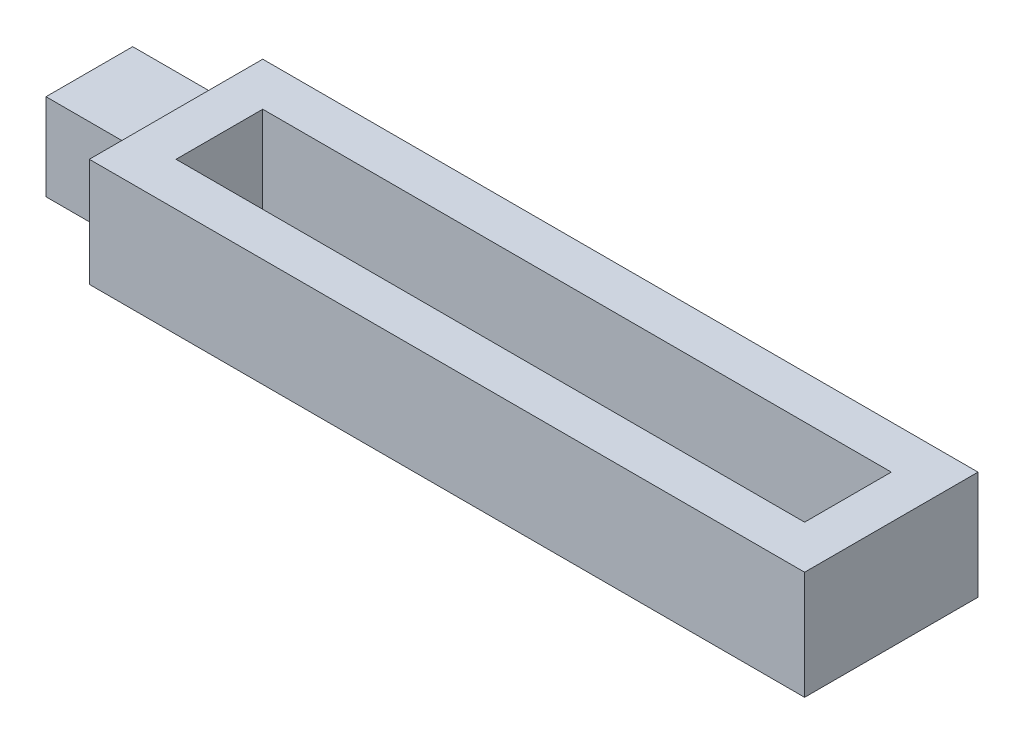
ISO-10303-21;
HEADER;
FILE_DESCRIPTION(('STEP AP214'),'2;1');
FILE_NAME('part.step','',(''),(''),'','','');
FILE_SCHEMA(('AUTOMOTIVE_DESIGN { 1 0 10303 214 1 1 1 1 }'));
ENDSEC;
DATA;
#1=APPLICATION_CONTEXT('core data for automotive mechanical design processes');
#2=APPLICATION_PROTOCOL_DEFINITION('international standard','automotive_design',2000,#1);
#3=PRODUCT_CONTEXT('',#1,'mechanical');
#4=PRODUCT('Part','Part','',(#3));
#5=PRODUCT_RELATED_PRODUCT_CATEGORY('part','',(#4));
#6=PRODUCT_DEFINITION_FORMATION('','',#4);
#7=PRODUCT_DEFINITION_CONTEXT('part definition',#1,'design');
#8=PRODUCT_DEFINITION('design','',#6,#7);
#9=PRODUCT_DEFINITION_SHAPE('','',#8);
#10=(LENGTH_UNIT() NAMED_UNIT(*) SI_UNIT(.MILLI.,.METRE.));
#11=(NAMED_UNIT(*) PLANE_ANGLE_UNIT() SI_UNIT($,.RADIAN.));
#12=(NAMED_UNIT(*) SI_UNIT($,.STERADIAN.) SOLID_ANGLE_UNIT());
#13=UNCERTAINTY_MEASURE_WITH_UNIT(LENGTH_MEASURE(1.E-05),#10,'distance_accuracy_value','');
#14=(GEOMETRIC_REPRESENTATION_CONTEXT(3) GLOBAL_UNCERTAINTY_ASSIGNED_CONTEXT((#13)) GLOBAL_UNIT_ASSIGNED_CONTEXT((#10,
#11,#12)) REPRESENTATION_CONTEXT('',''));
#15=CARTESIAN_POINT('',(0.,0.,0.));
#16=DIRECTION('',(0.,0.,1.));
#17=DIRECTION('',(1.,0.,0.));
#18=AXIS2_PLACEMENT_3D('',#15,#16,#17);
#19=CARTESIAN_POINT('',(330.,50.,0.));
#20=DIRECTION('',(1.,0.,0.));
#21=DIRECTION('',(0.,0.,-1.));
#22=AXIS2_PLACEMENT_3D('',#19,#20,#21);
#23=PLANE('',#22);
#24=DIRECTION('',(0.,-1.,0.));
#25=VECTOR('',#24,1.);
#26=CARTESIAN_POINT('',(330.,50.,79.9999999999999));
#27=LINE('',#26,#25);
#28=CARTESIAN_POINT('',(330.,50.,79.9999999999999));
#29=VERTEX_POINT('',#28);
#30=CARTESIAN_POINT('',(330.,-50.,79.9999999999999));
#31=VERTEX_POINT('',#30);
#32=EDGE_CURVE('E207',#29,#31,#27,.T.);
#33=ORIENTED_EDGE('',*,*,#32,.T.);
#34=DIRECTION('',(0.,0.,1.));
#35=VECTOR('',#34,1.);
#36=CARTESIAN_POINT('',(330.,-50.,0.));
#37=LINE('',#36,#35);
#38=CARTESIAN_POINT('',(330.,-50.,-79.9999999999999));
#39=VERTEX_POINT('',#38);
#40=EDGE_CURVE('E173',#39,#31,#37,.T.);
#41=ORIENTED_EDGE('',*,*,#40,.F.);
#42=DIRECTION('',(0.,-1.,0.));
#43=VECTOR('',#42,1.);
#44=CARTESIAN_POINT('',(330.,50.,-79.9999999999999));
#45=LINE('',#44,#43);
#46=CARTESIAN_POINT('',(330.,50.,-79.9999999999999));
#47=VERTEX_POINT('',#46);
#48=EDGE_CURVE('E11',#47,#39,#45,.T.);
#49=ORIENTED_EDGE('',*,*,#48,.F.);
#50=DIRECTION('',(0.,0.,1.));
#51=VECTOR('',#50,1.);
#52=CARTESIAN_POINT('',(330.,50.,0.));
#53=LINE('',#52,#51);
#54=EDGE_CURVE('E195',#47,#29,#53,.T.);
#55=ORIENTED_EDGE('',*,*,#54,.T.);
#56=EDGE_LOOP('',(#33,#41,#49,#55));
#57=FACE_BOUND('',#56,.T.);
#58=ADVANCED_FACE('F35',(#57),#23,.T.);
#59=CARTESIAN_POINT('',(0.,50.,-79.9999999999999));
#60=DIRECTION('',(0.,0.,-1.));
#61=DIRECTION('',(-1.,0.,0.));
#62=AXIS2_PLACEMENT_3D('',#59,#60,#61);
#63=PLANE('',#62);
#64=ORIENTED_EDGE('',*,*,#48,.T.);
#65=DIRECTION('',(1.,0.,0.));
#66=VECTOR('',#65,1.);
#67=CARTESIAN_POINT('',(0.,-50.,-79.9999999999999));
#68=LINE('',#67,#66);
#69=CARTESIAN_POINT('',(-330.,-50.,-79.9999999999999));
#70=VERTEX_POINT('',#69);
#71=EDGE_CURVE('E176',#70,#39,#68,.T.);
#72=ORIENTED_EDGE('',*,*,#71,.F.);
#73=DIRECTION('',(0.,-1.,0.));
#74=VECTOR('',#73,1.);
#75=CARTESIAN_POINT('',(-330.,50.,-79.9999999999999));
#76=LINE('',#75,#74);
#77=CARTESIAN_POINT('',(-330.,50.,-79.9999999999999));
#78=VERTEX_POINT('',#77);
#79=EDGE_CURVE('E44',#78,#70,#76,.T.);
#80=ORIENTED_EDGE('',*,*,#79,.F.);
#81=DIRECTION('',(1.,0.,0.));
#82=VECTOR('',#81,1.);
#83=CARTESIAN_POINT('',(0.,50.,-79.9999999999999));
#84=LINE('',#83,#82);
#85=EDGE_CURVE('E198',#78,#47,#84,.T.);
#86=ORIENTED_EDGE('',*,*,#85,.T.);
#87=EDGE_LOOP('',(#64,#72,#80,#86));
#88=FACE_BOUND('',#87,.T.);
#89=ADVANCED_FACE('F244',(#88),#63,.T.);
#90=CARTESIAN_POINT('',(-330.,50.,0.));
#91=DIRECTION('',(1.,0.,0.));
#92=DIRECTION('',(0.,0.,-1.));
#93=AXIS2_PLACEMENT_3D('',#90,#91,#92);
#94=PLANE('',#93);
#95=DIRECTION('',(0.,0.,1.));
#96=VECTOR('',#95,1.);
#97=CARTESIAN_POINT('',(-330.,-40.,0.));
#98=LINE('',#97,#96);
#99=CARTESIAN_POINT('',(-330.,-40.,-40.));
#100=VERTEX_POINT('',#99);
#101=CARTESIAN_POINT('',(-330.,-40.,39.9999999999999));
#102=VERTEX_POINT('',#101);
#103=EDGE_CURVE('E134',#100,#102,#98,.T.);
#104=ORIENTED_EDGE('',*,*,#103,.F.);
#105=DIRECTION('',(0.,1.,0.));
#106=VECTOR('',#105,1.);
#107=CARTESIAN_POINT('',(-330.,-40.,-40.));
#108=LINE('',#107,#106);
#109=CARTESIAN_POINT('',(-330.,40.,-40.));
#110=VERTEX_POINT('',#109);
#111=EDGE_CURVE('E52',#100,#110,#108,.T.);
#112=ORIENTED_EDGE('',*,*,#111,.T.);
#113=DIRECTION('',(0.,0.,1.));
#114=VECTOR('',#113,1.);
#115=CARTESIAN_POINT('',(-330.,40.,0.));
#116=LINE('',#115,#114);
#117=CARTESIAN_POINT('',(-330.,40.,39.9999999999999));
#118=VERTEX_POINT('',#117);
#119=EDGE_CURVE('E57',#110,#118,#116,.T.);
#120=ORIENTED_EDGE('',*,*,#119,.T.);
#121=DIRECTION('',(0.,1.,0.));
#122=VECTOR('',#121,1.);
#123=CARTESIAN_POINT('',(-330.,-40.,39.9999999999999));
#124=LINE('',#123,#122);
#125=EDGE_CURVE('E159',#102,#118,#124,.T.);
#126=ORIENTED_EDGE('',*,*,#125,.F.);
#127=EDGE_LOOP('',(#104,#112,#120,#126));
#128=FACE_BOUND('',#127,.T.);
#129=ORIENTED_EDGE('',*,*,#79,.T.);
#130=DIRECTION('',(0.,0.,1.));
#131=VECTOR('',#130,1.);
#132=CARTESIAN_POINT('',(-330.,-50.,0.));
#133=LINE('',#132,#131);
#134=CARTESIAN_POINT('',(-330.,-50.,79.9999999999999));
#135=VERTEX_POINT('',#134);
#136=EDGE_CURVE('E179',#70,#135,#133,.T.);
#137=ORIENTED_EDGE('',*,*,#136,.T.);
#138=DIRECTION('',(0.,-1.,0.));
#139=VECTOR('',#138,1.);
#140=CARTESIAN_POINT('',(-330.,50.,79.9999999999999));
#141=LINE('',#140,#139);
#142=CARTESIAN_POINT('',(-330.,50.,79.9999999999999));
#143=VERTEX_POINT('',#142);
#144=EDGE_CURVE('E209',#143,#135,#141,.T.);
#145=ORIENTED_EDGE('',*,*,#144,.F.);
#146=DIRECTION('',(0.,0.,1.));
#147=VECTOR('',#146,1.);
#148=CARTESIAN_POINT('',(-330.,50.,0.));
#149=LINE('',#148,#147);
#150=EDGE_CURVE('E201',#78,#143,#149,.T.);
#151=ORIENTED_EDGE('',*,*,#150,.F.);
#152=EDGE_LOOP('',(#129,#137,#145,#151));
#153=FACE_BOUND('',#152,.T.);
#154=ADVANCED_FACE('F250',(#128,#153),#94,.F.);
#155=CARTESIAN_POINT('',(290.,50.,0.));
#156=DIRECTION('',(-1.,0.,0.));
#157=DIRECTION('',(0.,0.,1.));
#158=AXIS2_PLACEMENT_3D('',#155,#156,#157);
#159=PLANE('',#158);
#160=DIRECTION('',(0.,-1.,0.));
#161=VECTOR('',#160,1.);
#162=CARTESIAN_POINT('',(290.,50.,-40.));
#163=LINE('',#162,#161);
#164=CARTESIAN_POINT('',(290.,50.,-40.));
#165=VERTEX_POINT('',#164);
#166=CARTESIAN_POINT('',(290.,-50.,-40.));
#167=VERTEX_POINT('',#166);
#168=EDGE_CURVE('E206',#165,#167,#163,.T.);
#169=ORIENTED_EDGE('',*,*,#168,.T.);
#170=DIRECTION('',(0.,0.,-1.));
#171=VECTOR('',#170,1.);
#172=CARTESIAN_POINT('',(290.,-50.,0.));
#173=LINE('',#172,#171);
#174=CARTESIAN_POINT('',(290.,-50.,40.));
#175=VERTEX_POINT('',#174);
#176=EDGE_CURVE('E158',#175,#167,#173,.T.);
#177=ORIENTED_EDGE('',*,*,#176,.F.);
#178=DIRECTION('',(0.,-1.,0.));
#179=VECTOR('',#178,1.);
#180=CARTESIAN_POINT('',(290.,50.,40.));
#181=LINE('',#180,#179);
#182=CARTESIAN_POINT('',(290.,50.,40.));
#183=VERTEX_POINT('',#182);
#184=EDGE_CURVE('E39',#183,#175,#181,.T.);
#185=ORIENTED_EDGE('',*,*,#184,.F.);
#186=DIRECTION('',(0.,0.,-1.));
#187=VECTOR('',#186,1.);
#188=CARTESIAN_POINT('',(290.,50.,0.));
#189=LINE('',#188,#187);
#190=EDGE_CURVE('E185',#183,#165,#189,.T.);
#191=ORIENTED_EDGE('',*,*,#190,.T.);
#192=EDGE_LOOP('',(#169,#177,#185,#191));
#193=FACE_BOUND('',#192,.T.);
#194=ADVANCED_FACE('F37',(#193),#159,.T.);
#195=CARTESIAN_POINT('',(0.,50.,40.));
#196=DIRECTION('',(0.,0.,-1.));
#197=DIRECTION('',(-1.,0.,0.));
#198=AXIS2_PLACEMENT_3D('',#195,#196,#197);
#199=PLANE('',#198);
#200=ORIENTED_EDGE('',*,*,#184,.T.);
#201=DIRECTION('',(1.,0.,0.));
#202=VECTOR('',#201,1.);
#203=CARTESIAN_POINT('',(0.,-50.,40.));
#204=LINE('',#203,#202);
#205=CARTESIAN_POINT('',(-290.,-50.,39.9999999999999));
#206=VERTEX_POINT('',#205);
#207=EDGE_CURVE('E164',#206,#175,#204,.T.);
#208=ORIENTED_EDGE('',*,*,#207,.F.);
#209=DIRECTION('',(0.,-1.,0.));
#210=VECTOR('',#209,1.);
#211=CARTESIAN_POINT('',(-290.,50.,39.9999999999999));
#212=LINE('',#211,#210);
#213=CARTESIAN_POINT('',(-290.,50.,39.9999999999999));
#214=VERTEX_POINT('',#213);
#215=EDGE_CURVE('E214',#214,#206,#212,.T.);
#216=ORIENTED_EDGE('',*,*,#215,.F.);
#217=DIRECTION('',(1.,0.,0.));
#218=VECTOR('',#217,1.);
#219=CARTESIAN_POINT('',(0.,50.,40.));
#220=LINE('',#219,#218);
#221=EDGE_CURVE('E188',#214,#183,#220,.T.);
#222=ORIENTED_EDGE('',*,*,#221,.T.);
#223=EDGE_LOOP('',(#200,#208,#216,#222));
#224=FACE_BOUND('',#223,.T.);
#225=ADVANCED_FACE('F219',(#224),#199,.T.);
#226=CARTESIAN_POINT('',(-290.,50.,0.));
#227=DIRECTION('',(-1.,0.,0.));
#228=DIRECTION('',(0.,0.,1.));
#229=AXIS2_PLACEMENT_3D('',#226,#227,#228);
#230=PLANE('',#229);
#231=ORIENTED_EDGE('',*,*,#215,.T.);
#232=DIRECTION('',(0.,0.,-1.));
#233=VECTOR('',#232,1.);
#234=CARTESIAN_POINT('',(-290.,-50.,0.));
#235=LINE('',#234,#233);
#236=CARTESIAN_POINT('',(-290.,-50.,-40.));
#237=VERTEX_POINT('',#236);
#238=EDGE_CURVE('E167',#206,#237,#235,.T.);
#239=ORIENTED_EDGE('',*,*,#238,.T.);
#240=DIRECTION('',(0.,-1.,0.));
#241=VECTOR('',#240,1.);
#242=CARTESIAN_POINT('',(-290.,50.,-40.));
#243=LINE('',#242,#241);
#244=CARTESIAN_POINT('',(-290.,50.,-40.));
#245=VERTEX_POINT('',#244);
#246=EDGE_CURVE('E213',#245,#237,#243,.T.);
#247=ORIENTED_EDGE('',*,*,#246,.F.);
#248=DIRECTION('',(0.,0.,-1.));
#249=VECTOR('',#248,1.);
#250=CARTESIAN_POINT('',(-290.,50.,0.));
#251=LINE('',#250,#249);
#252=EDGE_CURVE('E191',#214,#245,#251,.T.);
#253=ORIENTED_EDGE('',*,*,#252,.F.);
#254=EDGE_LOOP('',(#231,#239,#247,#253));
#255=FACE_BOUND('',#254,.T.);
#256=ADVANCED_FACE('F234',(#255),#230,.F.);
#257=CARTESIAN_POINT('',(0.,50.,-40.));
#258=DIRECTION('',(0.,0.,-1.));
#259=DIRECTION('',(-1.,0.,0.));
#260=AXIS2_PLACEMENT_3D('',#257,#258,#259);
#261=PLANE('',#260);
#262=ORIENTED_EDGE('',*,*,#246,.T.);
#263=DIRECTION('',(1.,0.,0.));
#264=VECTOR('',#263,1.);
#265=CARTESIAN_POINT('',(0.,-50.,-40.));
#266=LINE('',#265,#264);
#267=EDGE_CURVE('E170',#237,#167,#266,.T.);
#268=ORIENTED_EDGE('',*,*,#267,.T.);
#269=ORIENTED_EDGE('',*,*,#168,.F.);
#270=DIRECTION('',(1.,0.,0.));
#271=VECTOR('',#270,1.);
#272=CARTESIAN_POINT('',(0.,50.,-40.));
#273=LINE('',#272,#271);
#274=EDGE_CURVE('E193',#245,#165,#273,.T.);
#275=ORIENTED_EDGE('',*,*,#274,.F.);
#276=EDGE_LOOP('',(#262,#268,#269,#275));
#277=FACE_BOUND('',#276,.T.);
#278=ADVANCED_FACE('F232',(#277),#261,.F.);
#279=CARTESIAN_POINT('',(0.,50.,79.9999999999999));
#280=DIRECTION('',(0.,0.,-1.));
#281=DIRECTION('',(-1.,0.,0.));
#282=AXIS2_PLACEMENT_3D('',#279,#280,#281);
#283=PLANE('',#282);
#284=ORIENTED_EDGE('',*,*,#144,.T.);
#285=DIRECTION('',(1.,0.,0.));
#286=VECTOR('',#285,1.);
#287=CARTESIAN_POINT('',(0.,-50.,79.9999999999999));
#288=LINE('',#287,#286);
#289=EDGE_CURVE('E182',#135,#31,#288,.T.);
#290=ORIENTED_EDGE('',*,*,#289,.T.);
#291=ORIENTED_EDGE('',*,*,#32,.F.);
#292=DIRECTION('',(1.,0.,0.));
#293=VECTOR('',#292,1.);
#294=CARTESIAN_POINT('',(0.,50.,79.9999999999999));
#295=LINE('',#294,#293);
#296=EDGE_CURVE('E204',#143,#29,#295,.T.);
#297=ORIENTED_EDGE('',*,*,#296,.F.);
#298=EDGE_LOOP('',(#284,#290,#291,#297));
#299=FACE_BOUND('',#298,.T.);
#300=ADVANCED_FACE('F241',(#299),#283,.F.);
#301=CARTESIAN_POINT('',(0.,50.,0.));
#302=DIRECTION('',(0.,1.,0.));
#303=DIRECTION('',(0.,0.,1.));
#304=AXIS2_PLACEMENT_3D('',#301,#302,#303);
#305=PLANE('',#304);
#306=ORIENTED_EDGE('',*,*,#190,.F.);
#307=ORIENTED_EDGE('',*,*,#221,.F.);
#308=ORIENTED_EDGE('',*,*,#252,.T.);
#309=ORIENTED_EDGE('',*,*,#274,.T.);
#310=EDGE_LOOP('',(#306,#307,#308,#309));
#311=FACE_BOUND('',#310,.T.);
#312=ORIENTED_EDGE('',*,*,#54,.F.);
#313=ORIENTED_EDGE('',*,*,#85,.F.);
#314=ORIENTED_EDGE('',*,*,#150,.T.);
#315=ORIENTED_EDGE('',*,*,#296,.T.);
#316=EDGE_LOOP('',(#312,#313,#314,#315));
#317=FACE_BOUND('',#316,.T.);
#318=ADVANCED_FACE('F258',(#311,#317),#305,.T.);
#319=CARTESIAN_POINT('',(0.,-50.,0.));
#320=DIRECTION('',(0.,1.,0.));
#321=DIRECTION('',(0.,0.,1.));
#322=AXIS2_PLACEMENT_3D('',#319,#320,#321);
#323=PLANE('',#322);
#324=ORIENTED_EDGE('',*,*,#176,.T.);
#325=ORIENTED_EDGE('',*,*,#267,.F.);
#326=ORIENTED_EDGE('',*,*,#238,.F.);
#327=ORIENTED_EDGE('',*,*,#207,.T.);
#328=EDGE_LOOP('',(#324,#325,#326,#327));
#329=FACE_BOUND('',#328,.T.);
#330=ORIENTED_EDGE('',*,*,#40,.T.);
#331=ORIENTED_EDGE('',*,*,#289,.F.);
#332=ORIENTED_EDGE('',*,*,#136,.F.);
#333=ORIENTED_EDGE('',*,*,#71,.T.);
#334=EDGE_LOOP('',(#330,#331,#332,#333));
#335=FACE_BOUND('',#334,.T.);
#336=ADVANCED_FACE('F226',(#329,#335),#323,.F.);
#337=CARTESIAN_POINT('',(0.,-40.,-40.));
#338=DIRECTION('',(0.,0.,1.));
#339=DIRECTION('',(1.,0.,0.));
#340=AXIS2_PLACEMENT_3D('',#337,#338,#339);
#341=PLANE('',#340);
#342=DIRECTION('',(0.,1.,0.));
#343=VECTOR('',#342,1.);
#344=CARTESIAN_POINT('',(-410.,-40.,-40.));
#345=LINE('',#344,#343);
#346=CARTESIAN_POINT('',(-410.,-40.,-40.));
#347=VERTEX_POINT('',#346);
#348=CARTESIAN_POINT('',(-410.,40.,-40.));
#349=VERTEX_POINT('',#348);
#350=EDGE_CURVE('E124',#347,#349,#345,.T.);
#351=ORIENTED_EDGE('',*,*,#350,.T.);
#352=DIRECTION('',(1.,0.,0.));
#353=VECTOR('',#352,1.);
#354=CARTESIAN_POINT('',(0.,40.,-40.));
#355=LINE('',#354,#353);
#356=EDGE_CURVE('E127',#349,#110,#355,.T.);
#357=ORIENTED_EDGE('',*,*,#356,.T.);
#358=ORIENTED_EDGE('',*,*,#111,.F.);
#359=DIRECTION('',(1.,0.,0.));
#360=VECTOR('',#359,1.);
#361=CARTESIAN_POINT('',(0.,-40.,-40.));
#362=LINE('',#361,#360);
#363=EDGE_CURVE('E129',#347,#100,#362,.T.);
#364=ORIENTED_EDGE('',*,*,#363,.F.);
#365=EDGE_LOOP('',(#351,#357,#358,#364));
#366=FACE_BOUND('',#365,.T.);
#367=ADVANCED_FACE('F126',(#366),#341,.F.);
#368=CARTESIAN_POINT('',(0.,-40.,39.9999999999999));
#369=DIRECTION('',(0.,0.,-1.));
#370=DIRECTION('',(-1.,0.,0.));
#371=AXIS2_PLACEMENT_3D('',#368,#369,#370);
#372=PLANE('',#371);
#373=ORIENTED_EDGE('',*,*,#125,.T.);
#374=DIRECTION('',(-1.,0.,0.));
#375=VECTOR('',#374,1.);
#376=CARTESIAN_POINT('',(0.,40.,39.9999999999999));
#377=LINE('',#376,#375);
#378=CARTESIAN_POINT('',(-410.,40.,39.9999999999999));
#379=VERTEX_POINT('',#378);
#380=EDGE_CURVE('E145',#118,#379,#377,.T.);
#381=ORIENTED_EDGE('',*,*,#380,.T.);
#382=DIRECTION('',(0.,1.,0.));
#383=VECTOR('',#382,1.);
#384=CARTESIAN_POINT('',(-410.,-40.,39.9999999999999));
#385=LINE('',#384,#383);
#386=CARTESIAN_POINT('',(-410.,-40.,39.9999999999999));
#387=VERTEX_POINT('',#386);
#388=EDGE_CURVE('E133',#387,#379,#385,.T.);
#389=ORIENTED_EDGE('',*,*,#388,.F.);
#390=DIRECTION('',(-1.,0.,0.));
#391=VECTOR('',#390,1.);
#392=CARTESIAN_POINT('',(0.,-40.,39.9999999999999));
#393=LINE('',#392,#391);
#394=EDGE_CURVE('E153',#102,#387,#393,.T.);
#395=ORIENTED_EDGE('',*,*,#394,.F.);
#396=EDGE_LOOP('',(#373,#381,#389,#395));
#397=FACE_BOUND('',#396,.T.);
#398=ADVANCED_FACE('F267',(#397),#372,.F.);
#399=CARTESIAN_POINT('',(-410.,-40.,0.));
#400=DIRECTION('',(1.,0.,0.));
#401=DIRECTION('',(0.,0.,-1.));
#402=AXIS2_PLACEMENT_3D('',#399,#400,#401);
#403=PLANE('',#402);
#404=ORIENTED_EDGE('',*,*,#388,.T.);
#405=DIRECTION('',(0.,0.,-1.));
#406=VECTOR('',#405,1.);
#407=CARTESIAN_POINT('',(-410.,40.,0.));
#408=LINE('',#407,#406);
#409=EDGE_CURVE('E140',#379,#349,#408,.T.);
#410=ORIENTED_EDGE('',*,*,#409,.T.);
#411=ORIENTED_EDGE('',*,*,#350,.F.);
#412=DIRECTION('',(0.,0.,-1.));
#413=VECTOR('',#412,1.);
#414=CARTESIAN_POINT('',(-410.,-40.,0.));
#415=LINE('',#414,#413);
#416=EDGE_CURVE('E151',#387,#347,#415,.T.);
#417=ORIENTED_EDGE('',*,*,#416,.F.);
#418=EDGE_LOOP('',(#404,#410,#411,#417));
#419=FACE_BOUND('',#418,.T.);
#420=ADVANCED_FACE('F143',(#419),#403,.F.);
#421=CARTESIAN_POINT('',(0.,-40.,0.));
#422=DIRECTION('',(0.,1.,0.));
#423=DIRECTION('',(0.,0.,1.));
#424=AXIS2_PLACEMENT_3D('',#421,#422,#423);
#425=PLANE('',#424);
#426=ORIENTED_EDGE('',*,*,#363,.T.);
#427=ORIENTED_EDGE('',*,*,#103,.T.);
#428=ORIENTED_EDGE('',*,*,#394,.T.);
#429=ORIENTED_EDGE('',*,*,#416,.T.);
#430=EDGE_LOOP('',(#426,#427,#428,#429));
#431=FACE_BOUND('',#430,.T.);
#432=ADVANCED_FACE('F270',(#431),#425,.F.);
#433=CARTESIAN_POINT('',(0.,40.,0.));
#434=DIRECTION('',(0.,1.,0.));
#435=DIRECTION('',(0.,0.,1.));
#436=AXIS2_PLACEMENT_3D('',#433,#434,#435);
#437=PLANE('',#436);
#438=ORIENTED_EDGE('',*,*,#356,.F.);
#439=ORIENTED_EDGE('',*,*,#409,.F.);
#440=ORIENTED_EDGE('',*,*,#380,.F.);
#441=ORIENTED_EDGE('',*,*,#119,.F.);
#442=EDGE_LOOP('',(#438,#439,#440,#441));
#443=FACE_BOUND('',#442,.T.);
#444=ADVANCED_FACE('F138',(#443),#437,.T.);
#445=CLOSED_SHELL('',(#58,#89,#154,#194,#225,#256,#278,#300,#318,#336,#367,#398,#420,#432,#444));
#446=MANIFOLD_SOLID_BREP('B2',#445);
#447=ADVANCED_BREP_SHAPE_REPRESENTATION('',(#18,#446),#14);
#448=SHAPE_DEFINITION_REPRESENTATION(#9,#447);
ENDSEC;
END-ISO-10303-21;
